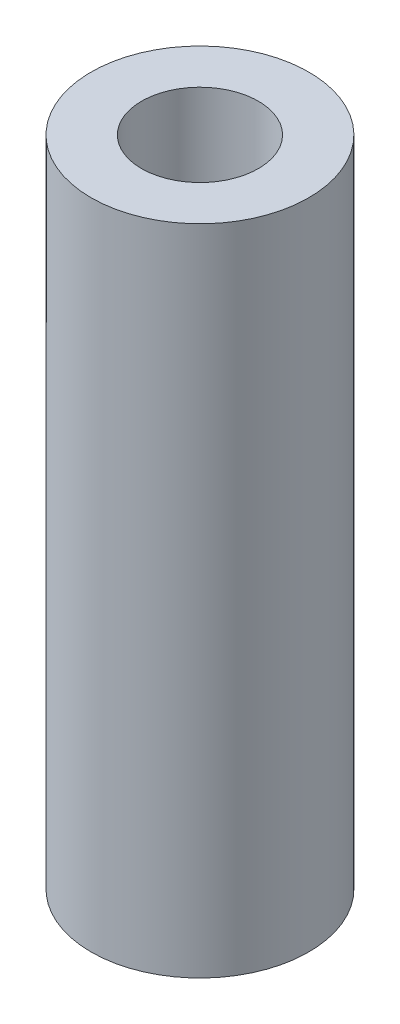
ISO-10303-21;
HEADER;
FILE_DESCRIPTION(('STEP AP214'),'2;1');
FILE_NAME('part.step','',(''),(''),'','','');
FILE_SCHEMA(('AUTOMOTIVE_DESIGN { 1 0 10303 214 1 1 1 1 }'));
ENDSEC;
DATA;
#1=APPLICATION_CONTEXT('core data for automotive mechanical design processes');
#2=APPLICATION_PROTOCOL_DEFINITION('international standard','automotive_design',2000,#1);
#3=PRODUCT_CONTEXT('',#1,'mechanical');
#4=PRODUCT('Part','Part','',(#3));
#5=PRODUCT_RELATED_PRODUCT_CATEGORY('part','',(#4));
#6=PRODUCT_DEFINITION_FORMATION('','',#4);
#7=PRODUCT_DEFINITION_CONTEXT('part definition',#1,'design');
#8=PRODUCT_DEFINITION('design','',#6,#7);
#9=PRODUCT_DEFINITION_SHAPE('','',#8);
#10=(LENGTH_UNIT() NAMED_UNIT(*) SI_UNIT(.MILLI.,.METRE.));
#11=(NAMED_UNIT(*) PLANE_ANGLE_UNIT() SI_UNIT($,.RADIAN.));
#12=(NAMED_UNIT(*) SI_UNIT($,.STERADIAN.) SOLID_ANGLE_UNIT());
#13=UNCERTAINTY_MEASURE_WITH_UNIT(LENGTH_MEASURE(1.E-05),#10,'distance_accuracy_value','');
#14=(GEOMETRIC_REPRESENTATION_CONTEXT(3) GLOBAL_UNCERTAINTY_ASSIGNED_CONTEXT((#13)) GLOBAL_UNIT_ASSIGNED_CONTEXT((#10,
#11,#12)) REPRESENTATION_CONTEXT('',''));
#15=CARTESIAN_POINT('',(0.,0.,0.));
#16=DIRECTION('',(0.,0.,1.));
#17=DIRECTION('',(1.,0.,0.));
#18=AXIS2_PLACEMENT_3D('',#15,#16,#17);
#19=CARTESIAN_POINT('',(0.,9.525,0.));
#20=DIRECTION('',(0.,-1.,0.));
#21=DIRECTION('',(0.,0.,-1.));
#22=AXIS2_PLACEMENT_3D('',#19,#20,#21);
#23=CYLINDRICAL_SURFACE('',#22,0.852069719472563);
#24=CARTESIAN_POINT('',(0.,9.525,0.));
#25=DIRECTION('',(0.,1.,0.));
#26=DIRECTION('',(0.,0.,1.));
#27=AXIS2_PLACEMENT_3D('',#24,#25,#26);
#28=CIRCLE('',#27,0.852069719472563);
#29=CARTESIAN_POINT('',(0.,9.525,0.852069719472563));
#30=VERTEX_POINT('',#29);
#31=EDGE_CURVE('E40',#30,#30,#28,.T.);
#32=ORIENTED_EDGE('',*,*,#31,.T.);
#33=EDGE_LOOP('',(#32));
#34=FACE_BOUND('',#33,.T.);
#35=CARTESIAN_POINT('',(0.,0.,0.));
#36=DIRECTION('',(0.,1.,0.));
#37=DIRECTION('',(0.,0.,1.));
#38=AXIS2_PLACEMENT_3D('',#35,#36,#37);
#39=CIRCLE('',#38,0.852069719472563);
#40=CARTESIAN_POINT('',(0.,0.,0.852069719472563));
#41=VERTEX_POINT('',#40);
#42=EDGE_CURVE('E46',#41,#41,#39,.T.);
#43=ORIENTED_EDGE('',*,*,#42,.F.);
#44=EDGE_LOOP('',(#43));
#45=FACE_BOUND('',#44,.T.);
#46=ADVANCED_FACE('F33',(#34,#45),#23,.F.);
#47=CARTESIAN_POINT('',(0.,9.525,0.));
#48=DIRECTION('',(0.,-1.,0.));
#49=DIRECTION('',(0.,0.,-1.));
#50=AXIS2_PLACEMENT_3D('',#47,#48,#49);
#51=CYLINDRICAL_SURFACE('',#50,1.5875);
#52=CARTESIAN_POINT('',(0.,9.525,0.));
#53=DIRECTION('',(0.,1.,0.));
#54=DIRECTION('',(0.,0.,1.));
#55=AXIS2_PLACEMENT_3D('',#52,#53,#54);
#56=CIRCLE('',#55,1.5875);
#57=CARTESIAN_POINT('',(0.,9.525,1.5875));
#58=VERTEX_POINT('',#57);
#59=EDGE_CURVE('E10',#58,#58,#56,.T.);
#60=ORIENTED_EDGE('',*,*,#59,.F.);
#61=EDGE_LOOP('',(#60));
#62=FACE_BOUND('',#61,.T.);
#63=CARTESIAN_POINT('',(0.,0.,0.));
#64=DIRECTION('',(0.,1.,0.));
#65=DIRECTION('',(0.,0.,1.));
#66=AXIS2_PLACEMENT_3D('',#63,#64,#65);
#67=CIRCLE('',#66,1.5875);
#68=CARTESIAN_POINT('',(0.,0.,1.5875));
#69=VERTEX_POINT('',#68);
#70=EDGE_CURVE('E36',#69,#69,#67,.T.);
#71=ORIENTED_EDGE('',*,*,#70,.T.);
#72=EDGE_LOOP('',(#71));
#73=FACE_BOUND('',#72,.T.);
#74=ADVANCED_FACE('F53',(#62,#73),#51,.T.);
#75=CARTESIAN_POINT('',(0.,9.525,0.));
#76=DIRECTION('',(0.,1.,0.));
#77=DIRECTION('',(0.,0.,1.));
#78=AXIS2_PLACEMENT_3D('',#75,#76,#77);
#79=PLANE('',#78);
#80=ORIENTED_EDGE('',*,*,#31,.F.);
#81=EDGE_LOOP('',(#80));
#82=FACE_BOUND('',#81,.T.);
#83=ORIENTED_EDGE('',*,*,#59,.T.);
#84=EDGE_LOOP('',(#83));
#85=FACE_BOUND('',#84,.T.);
#86=ADVANCED_FACE('F57',(#82,#85),#79,.T.);
#87=CARTESIAN_POINT('',(0.,0.,0.));
#88=DIRECTION('',(0.,1.,0.));
#89=DIRECTION('',(0.,0.,1.));
#90=AXIS2_PLACEMENT_3D('',#87,#88,#89);
#91=PLANE('',#90);
#92=ORIENTED_EDGE('',*,*,#42,.T.);
#93=EDGE_LOOP('',(#92));
#94=FACE_BOUND('',#93,.T.);
#95=ORIENTED_EDGE('',*,*,#70,.F.);
#96=EDGE_LOOP('',(#95));
#97=FACE_BOUND('',#96,.T.);
#98=ADVANCED_FACE('F55',(#94,#97),#91,.F.);
#99=CLOSED_SHELL('',(#46,#74,#86,#98));
#100=MANIFOLD_SOLID_BREP('B2',#99);
#101=ADVANCED_BREP_SHAPE_REPRESENTATION('',(#18,#100),#14);
#102=SHAPE_DEFINITION_REPRESENTATION(#9,#101);
ENDSEC;
END-ISO-10303-21;
